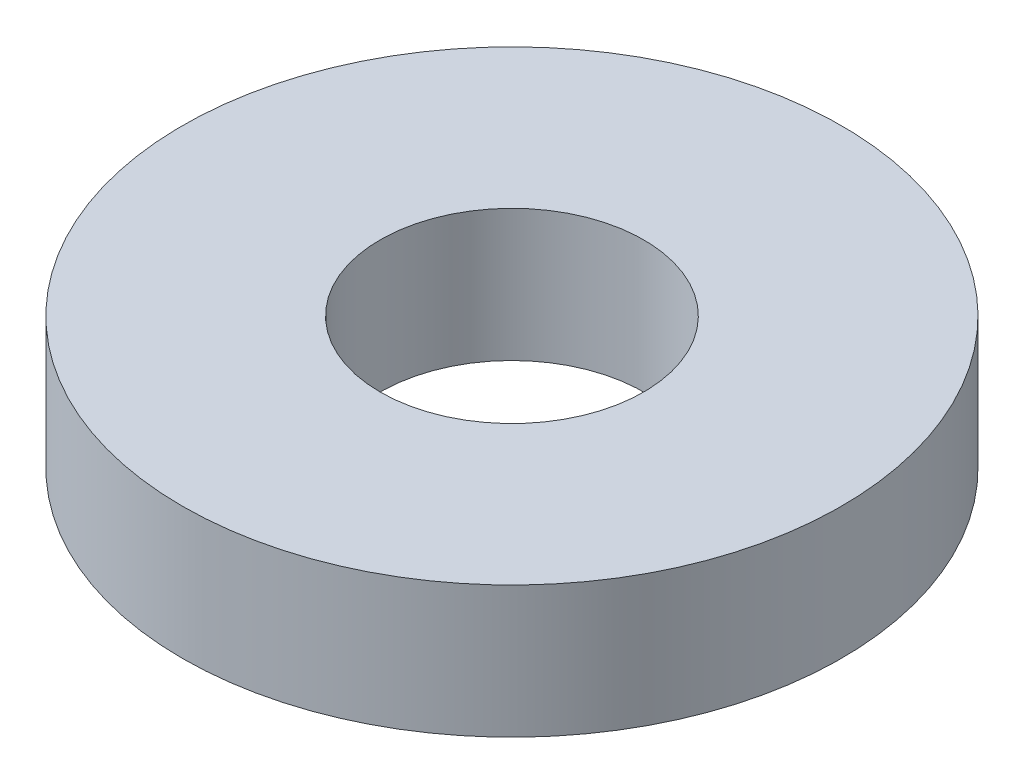
ISO-10303-21;
HEADER;
FILE_DESCRIPTION(('STEP AP214'),'2;1');
FILE_NAME('part.step','',(''),(''),'','','');
FILE_SCHEMA(('AUTOMOTIVE_DESIGN { 1 0 10303 214 1 1 1 1 }'));
ENDSEC;
DATA;
#1=APPLICATION_CONTEXT('core data for automotive mechanical design processes');
#2=APPLICATION_PROTOCOL_DEFINITION('international standard','automotive_design',2000,#1);
#3=PRODUCT_CONTEXT('',#1,'mechanical');
#4=PRODUCT('Part','Part','',(#3));
#5=PRODUCT_RELATED_PRODUCT_CATEGORY('part','',(#4));
#6=PRODUCT_DEFINITION_FORMATION('','',#4);
#7=PRODUCT_DEFINITION_CONTEXT('part definition',#1,'design');
#8=PRODUCT_DEFINITION('design','',#6,#7);
#9=PRODUCT_DEFINITION_SHAPE('','',#8);
#10=(LENGTH_UNIT() NAMED_UNIT(*) SI_UNIT(.MILLI.,.METRE.));
#11=(NAMED_UNIT(*) PLANE_ANGLE_UNIT() SI_UNIT($,.RADIAN.));
#12=(NAMED_UNIT(*) SI_UNIT($,.STERADIAN.) SOLID_ANGLE_UNIT());
#13=UNCERTAINTY_MEASURE_WITH_UNIT(LENGTH_MEASURE(1.E-05),#10,'distance_accuracy_value','');
#14=(GEOMETRIC_REPRESENTATION_CONTEXT(3) GLOBAL_UNCERTAINTY_ASSIGNED_CONTEXT((#13)) GLOBAL_UNIT_ASSIGNED_CONTEXT((#10,
#11,#12)) REPRESENTATION_CONTEXT('',''));
#15=CARTESIAN_POINT('',(0.,0.,0.));
#16=DIRECTION('',(0.,0.,1.));
#17=DIRECTION('',(1.,0.,0.));
#18=AXIS2_PLACEMENT_3D('',#15,#16,#17);
#19=CARTESIAN_POINT('',(0.,20.,0.));
#20=DIRECTION('',(0.,-1.,0.));
#21=DIRECTION('',(0.,0.,-1.));
#22=AXIS2_PLACEMENT_3D('',#19,#20,#21);
#23=CYLINDRICAL_SURFACE('',#22,50.);
#24=CARTESIAN_POINT('',(0.,20.,0.));
#25=DIRECTION('',(0.,1.,0.));
#26=DIRECTION('',(0.,0.,1.));
#27=AXIS2_PLACEMENT_3D('',#24,#25,#26);
#28=CIRCLE('',#27,50.);
#29=CARTESIAN_POINT('',(0.,20.,50.));
#30=VERTEX_POINT('',#29);
#31=EDGE_CURVE('E10',#30,#30,#28,.T.);
#32=ORIENTED_EDGE('',*,*,#31,.F.);
#33=EDGE_LOOP('',(#32));
#34=FACE_BOUND('',#33,.T.);
#35=CARTESIAN_POINT('',(0.,0.,0.));
#36=DIRECTION('',(0.,1.,0.));
#37=DIRECTION('',(0.,0.,1.));
#38=AXIS2_PLACEMENT_3D('',#35,#36,#37);
#39=CIRCLE('',#38,50.);
#40=CARTESIAN_POINT('',(0.,0.,50.));
#41=VERTEX_POINT('',#40);
#42=EDGE_CURVE('E37',#41,#41,#39,.T.);
#43=ORIENTED_EDGE('',*,*,#42,.T.);
#44=EDGE_LOOP('',(#43));
#45=FACE_BOUND('',#44,.T.);
#46=ADVANCED_FACE('F40',(#34,#45),#23,.T.);
#47=CARTESIAN_POINT('',(0.,20.,0.));
#48=DIRECTION('',(0.,1.,0.));
#49=DIRECTION('',(0.,0.,1.));
#50=AXIS2_PLACEMENT_3D('',#47,#48,#49);
#51=PLANE('',#50);
#52=CARTESIAN_POINT('',(0.,20.,0.));
#53=DIRECTION('',(0.,1.,0.));
#54=DIRECTION('',(0.,0.,1.));
#55=AXIS2_PLACEMENT_3D('',#52,#53,#54);
#56=CIRCLE('',#55,20.);
#57=CARTESIAN_POINT('',(0.,20.,20.));
#58=VERTEX_POINT('',#57);
#59=EDGE_CURVE('E50',#58,#58,#56,.T.);
#60=ORIENTED_EDGE('',*,*,#59,.F.);
#61=EDGE_LOOP('',(#60));
#62=FACE_BOUND('',#61,.T.);
#63=ORIENTED_EDGE('',*,*,#31,.T.);
#64=EDGE_LOOP('',(#63));
#65=FACE_BOUND('',#64,.T.);
#66=ADVANCED_FACE('F59',(#62,#65),#51,.T.);
#67=CARTESIAN_POINT('',(0.,0.,0.));
#68=DIRECTION('',(0.,1.,0.));
#69=DIRECTION('',(0.,0.,1.));
#70=AXIS2_PLACEMENT_3D('',#67,#68,#69);
#71=PLANE('',#70);
#72=CARTESIAN_POINT('',(0.,0.,0.));
#73=DIRECTION('',(0.,1.,0.));
#74=DIRECTION('',(0.,0.,1.));
#75=AXIS2_PLACEMENT_3D('',#72,#73,#74);
#76=CIRCLE('',#75,20.);
#77=CARTESIAN_POINT('',(0.,0.,20.));
#78=VERTEX_POINT('',#77);
#79=EDGE_CURVE('E47',#78,#78,#76,.T.);
#80=ORIENTED_EDGE('',*,*,#79,.T.);
#81=EDGE_LOOP('',(#80));
#82=FACE_BOUND('',#81,.T.);
#83=ORIENTED_EDGE('',*,*,#42,.F.);
#84=EDGE_LOOP('',(#83));
#85=FACE_BOUND('',#84,.T.);
#86=ADVANCED_FACE('F58',(#82,#85),#71,.F.);
#87=CARTESIAN_POINT('',(0.,20.,0.));
#88=DIRECTION('',(0.,-1.,0.));
#89=DIRECTION('',(0.,0.,-1.));
#90=AXIS2_PLACEMENT_3D('',#87,#88,#89);
#91=CYLINDRICAL_SURFACE('',#90,20.);
#92=ORIENTED_EDGE('',*,*,#59,.T.);
#93=EDGE_LOOP('',(#92));
#94=FACE_BOUND('',#93,.T.);
#95=ORIENTED_EDGE('',*,*,#79,.F.);
#96=EDGE_LOOP('',(#95));
#97=FACE_BOUND('',#96,.T.);
#98=ADVANCED_FACE('F54',(#94,#97),#91,.F.);
#99=CLOSED_SHELL('',(#46,#66,#86,#98));
#100=MANIFOLD_SOLID_BREP('B2',#99);
#101=ADVANCED_BREP_SHAPE_REPRESENTATION('',(#18,#100),#14);
#102=SHAPE_DEFINITION_REPRESENTATION(#9,#101);
ENDSEC;
END-ISO-10303-21;
